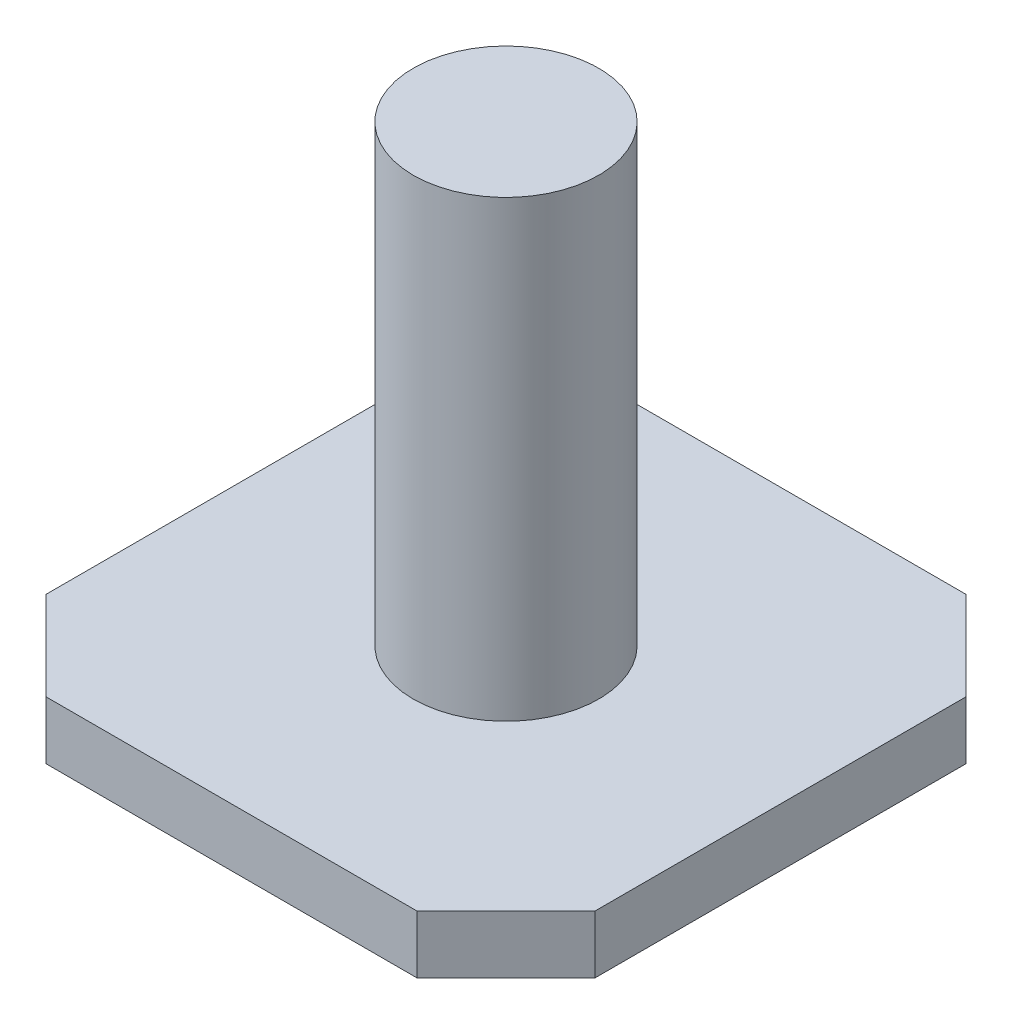
ISO-10303-21;
HEADER;
FILE_DESCRIPTION(('STEP AP214'),'2;1');
FILE_NAME('part.step','',(''),(''),'','','');
FILE_SCHEMA(('AUTOMOTIVE_DESIGN { 1 0 10303 214 1 1 1 1 }'));
ENDSEC;
DATA;
#1=APPLICATION_CONTEXT('core data for automotive mechanical design processes');
#2=APPLICATION_PROTOCOL_DEFINITION('international standard','automotive_design',2000,#1);
#3=PRODUCT_CONTEXT('',#1,'mechanical');
#4=PRODUCT('Part','Part','',(#3));
#5=PRODUCT_RELATED_PRODUCT_CATEGORY('part','',(#4));
#6=PRODUCT_DEFINITION_FORMATION('','',#4);
#7=PRODUCT_DEFINITION_CONTEXT('part definition',#1,'design');
#8=PRODUCT_DEFINITION('design','',#6,#7);
#9=PRODUCT_DEFINITION_SHAPE('','',#8);
#10=(LENGTH_UNIT() NAMED_UNIT(*) SI_UNIT(.MILLI.,.METRE.));
#11=(NAMED_UNIT(*) PLANE_ANGLE_UNIT() SI_UNIT($,.RADIAN.));
#12=(NAMED_UNIT(*) SI_UNIT($,.STERADIAN.) SOLID_ANGLE_UNIT());
#13=UNCERTAINTY_MEASURE_WITH_UNIT(LENGTH_MEASURE(1.E-05),#10,'distance_accuracy_value','');
#14=(GEOMETRIC_REPRESENTATION_CONTEXT(3) GLOBAL_UNCERTAINTY_ASSIGNED_CONTEXT((#13)) GLOBAL_UNIT_ASSIGNED_CONTEXT((#10,
#11,#12)) REPRESENTATION_CONTEXT('',''));
#15=CARTESIAN_POINT('',(0.,0.,0.));
#16=DIRECTION('',(0.,0.,1.));
#17=DIRECTION('',(1.,0.,0.));
#18=AXIS2_PLACEMENT_3D('',#15,#16,#17);
#19=CARTESIAN_POINT('',(-9.017,1.905,-6.096));
#20=DIRECTION('',(0.707106781186544,0.,0.707106781186551));
#21=DIRECTION('',(0.707106781186551,0.,-0.707106781186544));
#22=AXIS2_PLACEMENT_3D('',#19,#20,#21);
#23=PLANE('',#22);
#24=DIRECTION('',(-0.707106781186551,0.,0.707106781186544));
#25=VECTOR('',#24,1.);
#26=CARTESIAN_POINT('',(-9.017,0.,-6.096));
#27=LINE('',#26,#25);
#28=CARTESIAN_POINT('',(-6.09600000000006,0.,-9.01699999999991));
#29=VERTEX_POINT('',#28);
#30=CARTESIAN_POINT('',(-9.017,0.,-6.096));
#31=VERTEX_POINT('',#30);
#32=EDGE_CURVE('E134',#29,#31,#27,.T.);
#33=ORIENTED_EDGE('',*,*,#32,.T.);
#34=DIRECTION('',(0.,-1.,0.));
#35=VECTOR('',#34,1.);
#36=CARTESIAN_POINT('',(-9.017,1.905,-6.096));
#37=LINE('',#36,#35);
#38=CARTESIAN_POINT('',(-9.017,1.905,-6.096));
#39=VERTEX_POINT('',#38);
#40=EDGE_CURVE('E39',#39,#31,#37,.T.);
#41=ORIENTED_EDGE('',*,*,#40,.F.);
#42=DIRECTION('',(-0.707106781186551,0.,0.707106781186544));
#43=VECTOR('',#42,1.);
#44=CARTESIAN_POINT('',(-9.017,1.905,-6.096));
#45=LINE('',#44,#43);
#46=CARTESIAN_POINT('',(-6.09600000000006,1.905,-9.01699999999991));
#47=VERTEX_POINT('',#46);
#48=EDGE_CURVE('E149',#47,#39,#45,.T.);
#49=ORIENTED_EDGE('',*,*,#48,.F.);
#50=DIRECTION('',(0.,-1.,0.));
#51=VECTOR('',#50,1.);
#52=CARTESIAN_POINT('',(-6.09600000000006,1.905,-9.01699999999991));
#53=LINE('',#52,#51);
#54=EDGE_CURVE('E130',#47,#29,#53,.T.);
#55=ORIENTED_EDGE('',*,*,#54,.T.);
#56=EDGE_LOOP('',(#33,#41,#49,#55));
#57=FACE_BOUND('',#56,.T.);
#58=ADVANCED_FACE('F36',(#57),#23,.F.);
#59=CARTESIAN_POINT('',(-9.017,1.905,6.096));
#60=DIRECTION('',(1.,0.,0.));
#61=DIRECTION('',(0.,0.,-1.));
#62=AXIS2_PLACEMENT_3D('',#59,#60,#61);
#63=PLANE('',#62);
#64=DIRECTION('',(0.,0.,1.));
#65=VECTOR('',#64,1.);
#66=CARTESIAN_POINT('',(-9.017,0.,6.096));
#67=LINE('',#66,#65);
#68=CARTESIAN_POINT('',(-9.017,0.,6.096));
#69=VERTEX_POINT('',#68);
#70=EDGE_CURVE('E137',#31,#69,#67,.T.);
#71=ORIENTED_EDGE('',*,*,#70,.T.);
#72=DIRECTION('',(0.,-1.,0.));
#73=VECTOR('',#72,1.);
#74=CARTESIAN_POINT('',(-9.017,1.905,6.096));
#75=LINE('',#74,#73);
#76=CARTESIAN_POINT('',(-9.017,1.905,6.096));
#77=VERTEX_POINT('',#76);
#78=EDGE_CURVE('E158',#77,#69,#75,.T.);
#79=ORIENTED_EDGE('',*,*,#78,.F.);
#80=DIRECTION('',(0.,0.,1.));
#81=VECTOR('',#80,1.);
#82=CARTESIAN_POINT('',(-9.017,1.905,6.096));
#83=LINE('',#82,#81);
#84=EDGE_CURVE('E97',#39,#77,#83,.T.);
#85=ORIENTED_EDGE('',*,*,#84,.F.);
#86=ORIENTED_EDGE('',*,*,#40,.T.);
#87=EDGE_LOOP('',(#71,#79,#85,#86));
#88=FACE_BOUND('',#87,.T.);
#89=ADVANCED_FACE('F164',(#88),#63,.F.);
#90=CARTESIAN_POINT('',(-6.09600000000005,1.905,9.01699999999992));
#91=DIRECTION('',(0.707106781186544,0.,-0.707106781186551));
#92=DIRECTION('',(-0.707106781186551,0.,-0.707106781186544));
#93=AXIS2_PLACEMENT_3D('',#90,#91,#92);
#94=PLANE('',#93);
#95=DIRECTION('',(0.707106781186551,0.,0.707106781186544));
#96=VECTOR('',#95,1.);
#97=CARTESIAN_POINT('',(-6.09600000000005,0.,9.01699999999992));
#98=LINE('',#97,#96);
#99=CARTESIAN_POINT('',(-6.09600000000005,0.,9.01699999999992));
#100=VERTEX_POINT('',#99);
#101=EDGE_CURVE('E140',#69,#100,#98,.T.);
#102=ORIENTED_EDGE('',*,*,#101,.T.);
#103=DIRECTION('',(0.,-1.,0.));
#104=VECTOR('',#103,1.);
#105=CARTESIAN_POINT('',(-6.09600000000005,1.905,9.01699999999992));
#106=LINE('',#105,#104);
#107=CARTESIAN_POINT('',(-6.09600000000005,1.905,9.01699999999992));
#108=VERTEX_POINT('',#107);
#109=EDGE_CURVE('E156',#108,#100,#106,.T.);
#110=ORIENTED_EDGE('',*,*,#109,.F.);
#111=DIRECTION('',(0.707106781186551,0.,0.707106781186544));
#112=VECTOR('',#111,1.);
#113=CARTESIAN_POINT('',(-6.09600000000005,1.905,9.01699999999992));
#114=LINE('',#113,#112);
#115=EDGE_CURVE('E179',#77,#108,#114,.T.);
#116=ORIENTED_EDGE('',*,*,#115,.F.);
#117=ORIENTED_EDGE('',*,*,#78,.T.);
#118=EDGE_LOOP('',(#102,#110,#116,#117));
#119=FACE_BOUND('',#118,.T.);
#120=ADVANCED_FACE('F173',(#119),#94,.F.);
#121=CARTESIAN_POINT('',(6.096,1.905,9.01699999999992));
#122=DIRECTION('',(0.,0.,-1.));
#123=DIRECTION('',(-1.,0.,0.));
#124=AXIS2_PLACEMENT_3D('',#121,#122,#123);
#125=PLANE('',#124);
#126=DIRECTION('',(1.,0.,0.));
#127=VECTOR('',#126,1.);
#128=CARTESIAN_POINT('',(6.096,0.,9.01699999999992));
#129=LINE('',#128,#127);
#130=CARTESIAN_POINT('',(6.096,0.,9.01699999999992));
#131=VERTEX_POINT('',#130);
#132=EDGE_CURVE('E142',#100,#131,#129,.T.);
#133=ORIENTED_EDGE('',*,*,#132,.T.);
#134=DIRECTION('',(0.,-1.,0.));
#135=VECTOR('',#134,1.);
#136=CARTESIAN_POINT('',(6.096,1.905,9.01699999999992));
#137=LINE('',#136,#135);
#138=CARTESIAN_POINT('',(6.096,1.905,9.01699999999992));
#139=VERTEX_POINT('',#138);
#140=EDGE_CURVE('E153',#139,#131,#137,.T.);
#141=ORIENTED_EDGE('',*,*,#140,.F.);
#142=DIRECTION('',(1.,0.,0.));
#143=VECTOR('',#142,1.);
#144=CARTESIAN_POINT('',(6.096,1.905,9.01699999999992));
#145=LINE('',#144,#143);
#146=EDGE_CURVE('E178',#108,#139,#145,.T.);
#147=ORIENTED_EDGE('',*,*,#146,.F.);
#148=ORIENTED_EDGE('',*,*,#109,.T.);
#149=EDGE_LOOP('',(#133,#141,#147,#148));
#150=FACE_BOUND('',#149,.T.);
#151=ADVANCED_FACE('F176',(#150),#125,.F.);
#152=CARTESIAN_POINT('',(9.017,1.905,6.096));
#153=DIRECTION('',(-0.707106781186538,0.,-0.707106781186557));
#154=DIRECTION('',(-0.707106781186557,0.,0.707106781186538));
#155=AXIS2_PLACEMENT_3D('',#152,#153,#154);
#156=PLANE('',#155);
#157=DIRECTION('',(0.707106781186557,0.,-0.707106781186538));
#158=VECTOR('',#157,1.);
#159=CARTESIAN_POINT('',(9.017,0.,6.096));
#160=LINE('',#159,#158);
#161=CARTESIAN_POINT('',(9.017,0.,6.096));
#162=VERTEX_POINT('',#161);
#163=EDGE_CURVE('E144',#131,#162,#160,.T.);
#164=ORIENTED_EDGE('',*,*,#163,.T.);
#165=DIRECTION('',(0.,-1.,0.));
#166=VECTOR('',#165,1.);
#167=CARTESIAN_POINT('',(9.017,1.905,6.096));
#168=LINE('',#167,#166);
#169=CARTESIAN_POINT('',(9.017,1.905,6.096));
#170=VERTEX_POINT('',#169);
#171=EDGE_CURVE('E125',#170,#162,#168,.T.);
#172=ORIENTED_EDGE('',*,*,#171,.F.);
#173=DIRECTION('',(0.707106781186557,0.,-0.707106781186538));
#174=VECTOR('',#173,1.);
#175=CARTESIAN_POINT('',(9.017,1.905,6.096));
#176=LINE('',#175,#174);
#177=EDGE_CURVE('E116',#139,#170,#176,.T.);
#178=ORIENTED_EDGE('',*,*,#177,.F.);
#179=ORIENTED_EDGE('',*,*,#140,.T.);
#180=EDGE_LOOP('',(#164,#172,#178,#179));
#181=FACE_BOUND('',#180,.T.);
#182=ADVANCED_FACE('F216',(#181),#156,.F.);
#183=CARTESIAN_POINT('',(9.017,1.905,-6.096));
#184=DIRECTION('',(-1.,0.,0.));
#185=DIRECTION('',(0.,0.,1.));
#186=AXIS2_PLACEMENT_3D('',#183,#184,#185);
#187=PLANE('',#186);
#188=DIRECTION('',(0.,0.,-1.));
#189=VECTOR('',#188,1.);
#190=CARTESIAN_POINT('',(9.017,0.,-6.096));
#191=LINE('',#190,#189);
#192=CARTESIAN_POINT('',(9.017,0.,-6.096));
#193=VERTEX_POINT('',#192);
#194=EDGE_CURVE('E124',#162,#193,#191,.T.);
#195=ORIENTED_EDGE('',*,*,#194,.T.);
#196=DIRECTION('',(0.,-1.,0.));
#197=VECTOR('',#196,1.);
#198=CARTESIAN_POINT('',(9.017,1.905,-6.096));
#199=LINE('',#198,#197);
#200=CARTESIAN_POINT('',(9.017,1.905,-6.096));
#201=VERTEX_POINT('',#200);
#202=EDGE_CURVE('E121',#201,#193,#199,.T.);
#203=ORIENTED_EDGE('',*,*,#202,.F.);
#204=DIRECTION('',(0.,0.,-1.));
#205=VECTOR('',#204,1.);
#206=CARTESIAN_POINT('',(9.017,1.905,-6.096));
#207=LINE('',#206,#205);
#208=EDGE_CURVE('E110',#170,#201,#207,.T.);
#209=ORIENTED_EDGE('',*,*,#208,.F.);
#210=ORIENTED_EDGE('',*,*,#171,.T.);
#211=EDGE_LOOP('',(#195,#203,#209,#210));
#212=FACE_BOUND('',#211,.T.);
#213=ADVANCED_FACE('F122',(#212),#187,.F.);
#214=CARTESIAN_POINT('',(6.096,1.905,-9.0169999999999));
#215=DIRECTION('',(-0.707106781186536,0.,0.707106781186559));
#216=DIRECTION('',(0.707106781186559,0.,0.707106781186536));
#217=AXIS2_PLACEMENT_3D('',#214,#215,#216);
#218=PLANE('',#217);
#219=DIRECTION('',(-0.707106781186559,0.,-0.707106781186536));
#220=VECTOR('',#219,1.);
#221=CARTESIAN_POINT('',(6.096,0.,-9.0169999999999));
#222=LINE('',#221,#220);
#223=CARTESIAN_POINT('',(6.096,0.,-9.0169999999999));
#224=VERTEX_POINT('',#223);
#225=EDGE_CURVE('E82',#193,#224,#222,.T.);
#226=ORIENTED_EDGE('',*,*,#225,.T.);
#227=DIRECTION('',(0.,-1.,0.));
#228=VECTOR('',#227,1.);
#229=CARTESIAN_POINT('',(6.096,1.905,-9.0169999999999));
#230=LINE('',#229,#228);
#231=CARTESIAN_POINT('',(6.096,1.905,-9.0169999999999));
#232=VERTEX_POINT('',#231);
#233=EDGE_CURVE('E126',#232,#224,#230,.T.);
#234=ORIENTED_EDGE('',*,*,#233,.F.);
#235=DIRECTION('',(-0.707106781186559,0.,-0.707106781186536));
#236=VECTOR('',#235,1.);
#237=CARTESIAN_POINT('',(6.096,1.905,-9.0169999999999));
#238=LINE('',#237,#236);
#239=EDGE_CURVE('E114',#201,#232,#238,.T.);
#240=ORIENTED_EDGE('',*,*,#239,.F.);
#241=ORIENTED_EDGE('',*,*,#202,.T.);
#242=EDGE_LOOP('',(#226,#234,#240,#241));
#243=FACE_BOUND('',#242,.T.);
#244=ADVANCED_FACE('F128',(#243),#218,.F.);
#245=CARTESIAN_POINT('',(-6.09600000000006,1.905,-9.01699999999991));
#246=DIRECTION('',(0.,0.,1.));
#247=DIRECTION('',(1.,0.,0.));
#248=AXIS2_PLACEMENT_3D('',#245,#246,#247);
#249=PLANE('',#248);
#250=DIRECTION('',(-1.,0.,0.));
#251=VECTOR('',#250,1.);
#252=CARTESIAN_POINT('',(-6.09600000000006,0.,-9.01699999999991));
#253=LINE('',#252,#251);
#254=EDGE_CURVE('E88',#224,#29,#253,.T.);
#255=ORIENTED_EDGE('',*,*,#254,.T.);
#256=ORIENTED_EDGE('',*,*,#54,.F.);
#257=DIRECTION('',(-1.,0.,0.));
#258=VECTOR('',#257,1.);
#259=CARTESIAN_POINT('',(-6.09600000000006,1.905,-9.01699999999991));
#260=LINE('',#259,#258);
#261=EDGE_CURVE('E53',#232,#47,#260,.T.);
#262=ORIENTED_EDGE('',*,*,#261,.F.);
#263=ORIENTED_EDGE('',*,*,#233,.T.);
#264=EDGE_LOOP('',(#255,#256,#262,#263));
#265=FACE_BOUND('',#264,.T.);
#266=ADVANCED_FACE('F197',(#265),#249,.F.);
#267=CARTESIAN_POINT('',(0.,1.905,0.));
#268=DIRECTION('',(0.,-1.,0.));
#269=DIRECTION('',(0.,0.,-1.));
#270=AXIS2_PLACEMENT_3D('',#267,#268,#269);
#271=PLANE('',#270);
#272=CARTESIAN_POINT('',(0.,1.905,0.));
#273=DIRECTION('',(0.,1.,0.));
#274=DIRECTION('',(0.,0.,1.));
#275=AXIS2_PLACEMENT_3D('',#272,#273,#274);
#276=CIRCLE('',#275,3.048);
#277=CARTESIAN_POINT('',(0.,1.905,3.048));
#278=VERTEX_POINT('',#277);
#279=EDGE_CURVE('E11',#278,#278,#276,.T.);
#280=ORIENTED_EDGE('',*,*,#279,.F.);
#281=EDGE_LOOP('',(#280));
#282=FACE_BOUND('',#281,.T.);
#283=ORIENTED_EDGE('',*,*,#48,.T.);
#284=ORIENTED_EDGE('',*,*,#84,.T.);
#285=ORIENTED_EDGE('',*,*,#115,.T.);
#286=ORIENTED_EDGE('',*,*,#146,.T.);
#287=ORIENTED_EDGE('',*,*,#177,.T.);
#288=ORIENTED_EDGE('',*,*,#208,.T.);
#289=ORIENTED_EDGE('',*,*,#239,.T.);
#290=ORIENTED_EDGE('',*,*,#261,.T.);
#291=EDGE_LOOP('',(#283,#284,#285,#286,#287,#288,#289,#290));
#292=FACE_BOUND('',#291,.T.);
#293=ADVANCED_FACE('F112',(#282,#292),#271,.F.);
#294=CARTESIAN_POINT('',(0.,0.,0.));
#295=DIRECTION('',(0.,-1.,0.));
#296=DIRECTION('',(0.,0.,-1.));
#297=AXIS2_PLACEMENT_3D('',#294,#295,#296);
#298=PLANE('',#297);
#299=ORIENTED_EDGE('',*,*,#32,.F.);
#300=ORIENTED_EDGE('',*,*,#254,.F.);
#301=ORIENTED_EDGE('',*,*,#225,.F.);
#302=ORIENTED_EDGE('',*,*,#194,.F.);
#303=ORIENTED_EDGE('',*,*,#163,.F.);
#304=ORIENTED_EDGE('',*,*,#132,.F.);
#305=ORIENTED_EDGE('',*,*,#101,.F.);
#306=ORIENTED_EDGE('',*,*,#70,.F.);
#307=EDGE_LOOP('',(#299,#300,#301,#302,#303,#304,#305,#306));
#308=FACE_BOUND('',#307,.T.);
#309=ADVANCED_FACE('F169',(#308),#298,.T.);
#310=CARTESIAN_POINT('',(0.,16.8148,0.));
#311=DIRECTION('',(0.,-1.,0.));
#312=DIRECTION('',(0.,0.,-1.));
#313=AXIS2_PLACEMENT_3D('',#310,#311,#312);
#314=CYLINDRICAL_SURFACE('',#313,3.048);
#315=CARTESIAN_POINT('',(0.,16.8148,0.));
#316=DIRECTION('',(0.,1.,0.));
#317=DIRECTION('',(0.,0.,1.));
#318=AXIS2_PLACEMENT_3D('',#315,#316,#317);
#319=CIRCLE('',#318,3.048);
#320=CARTESIAN_POINT('',(0.,16.8148,3.048));
#321=VERTEX_POINT('',#320);
#322=EDGE_CURVE('E138',#321,#321,#319,.T.);
#323=ORIENTED_EDGE('',*,*,#322,.F.);
#324=EDGE_LOOP('',(#323));
#325=FACE_BOUND('',#324,.T.);
#326=ORIENTED_EDGE('',*,*,#279,.T.);
#327=EDGE_LOOP('',(#326));
#328=FACE_BOUND('',#327,.T.);
#329=ADVANCED_FACE('F190',(#325,#328),#314,.T.);
#330=CARTESIAN_POINT('',(0.,16.8148,0.));
#331=DIRECTION('',(0.,1.,0.));
#332=DIRECTION('',(0.,0.,1.));
#333=AXIS2_PLACEMENT_3D('',#330,#331,#332);
#334=PLANE('',#333);
#335=ORIENTED_EDGE('',*,*,#322,.T.);
#336=EDGE_LOOP('',(#335));
#337=FACE_BOUND('',#336,.T.);
#338=ADVANCED_FACE('F188',(#337),#334,.T.);
#339=CLOSED_SHELL('',(#58,#89,#120,#151,#182,#213,#244,#266,#293,#309,#329,#338));
#340=MANIFOLD_SOLID_BREP('B2',#339);
#341=ADVANCED_BREP_SHAPE_REPRESENTATION('',(#18,#340),#14);
#342=SHAPE_DEFINITION_REPRESENTATION(#9,#341);
ENDSEC;
END-ISO-10303-21;
